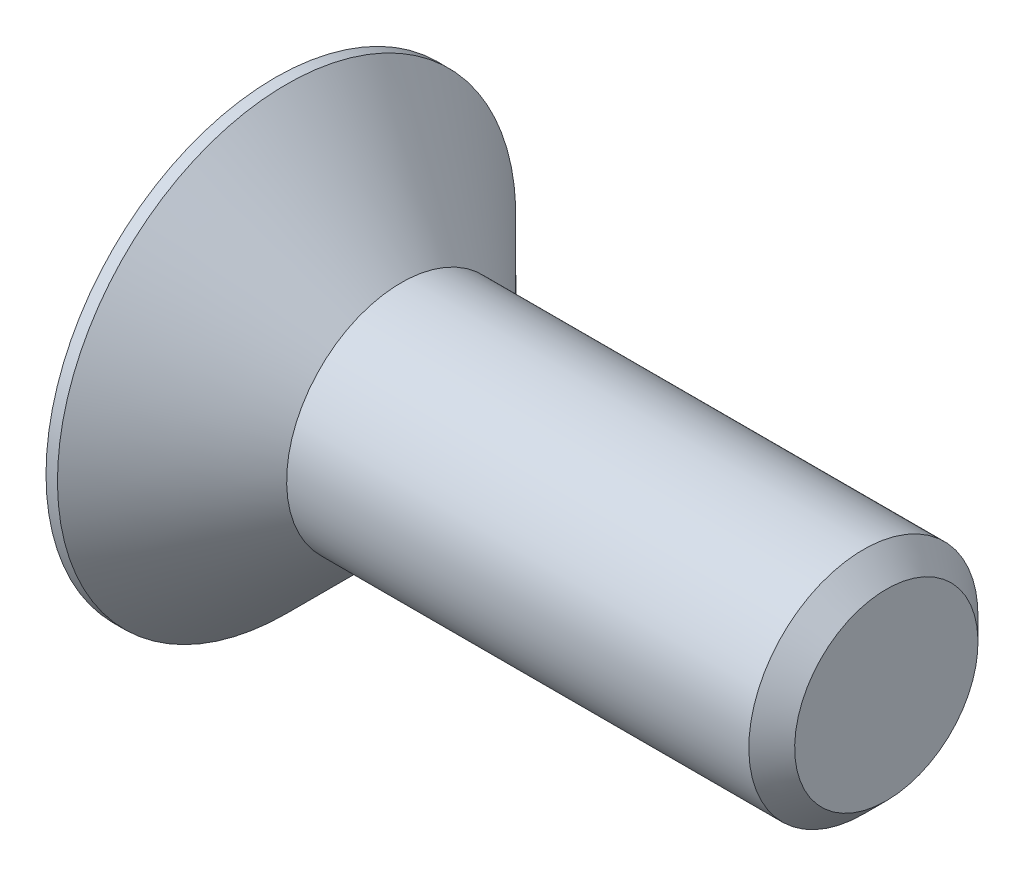
ISO-10303-21;
HEADER;
FILE_DESCRIPTION(('STEP AP214'),'2;1');
FILE_NAME('part.step','',(''),(''),'','','');
FILE_SCHEMA(('AUTOMOTIVE_DESIGN { 1 0 10303 214 1 1 1 1 }'));
ENDSEC;
DATA;
#1=APPLICATION_CONTEXT('core data for automotive mechanical design processes');
#2=APPLICATION_PROTOCOL_DEFINITION('international standard','automotive_design',2000,#1);
#3=PRODUCT_CONTEXT('',#1,'mechanical');
#4=PRODUCT('Part','Part','',(#3));
#5=PRODUCT_RELATED_PRODUCT_CATEGORY('part','',(#4));
#6=PRODUCT_DEFINITION_FORMATION('','',#4);
#7=PRODUCT_DEFINITION_CONTEXT('part definition',#1,'design');
#8=PRODUCT_DEFINITION('design','',#6,#7);
#9=PRODUCT_DEFINITION_SHAPE('','',#8);
#10=(LENGTH_UNIT() NAMED_UNIT(*) SI_UNIT(.MILLI.,.METRE.));
#11=(NAMED_UNIT(*) PLANE_ANGLE_UNIT() SI_UNIT($,.RADIAN.));
#12=(NAMED_UNIT(*) SI_UNIT($,.STERADIAN.) SOLID_ANGLE_UNIT());
#13=UNCERTAINTY_MEASURE_WITH_UNIT(LENGTH_MEASURE(1.E-05),#10,'distance_accuracy_value','');
#14=(GEOMETRIC_REPRESENTATION_CONTEXT(3) GLOBAL_UNCERTAINTY_ASSIGNED_CONTEXT((#13)) GLOBAL_UNIT_ASSIGNED_CONTEXT((#10,
#11,#12)) REPRESENTATION_CONTEXT('',''));
#15=CARTESIAN_POINT('',(0.,0.,0.));
#16=DIRECTION('',(0.,0.,1.));
#17=DIRECTION('',(1.,0.,0.));
#18=AXIS2_PLACEMENT_3D('',#15,#16,#17);
#19=CARTESIAN_POINT('',(1.65000000000121,32.4759531120805,-18.7500000629951));
#20=DIRECTION('',(-1.,0.,0.));
#21=DIRECTION('',(0.,-1.,0.));
#22=AXIS2_PLACEMENT_3D('',#19,#20,#21);
#23=PLANE('',#22);
#24=DIRECTION('',(0.,-0.5,-0.866025403784439));
#25=VECTOR('',#24,1.);
#26=CARTESIAN_POINT('',(1.65000000000109,30.7439023045116,-17.7500000629951));
#27=LINE('',#26,#25);
#28=CARTESIAN_POINT('',(1.65000000000112,30.166552035322,-18.7500000629951));
#29=VERTEX_POINT('',#28);
#30=CARTESIAN_POINT('',(1.65000000000109,31.3212525737013,-16.7500000629951));
#31=VERTEX_POINT('',#30);
#32=EDGE_CURVE('E83',#29,#31,#27,.F.);
#33=ORIENTED_EDGE('',*,*,#32,.T.);
#34=DIRECTION('',(0.,1.,0.));
#35=VECTOR('',#34,1.);
#36=CARTESIAN_POINT('',(1.65000000000109,32.4759531120806,-16.7500000629951));
#37=LINE('',#36,#35);
#38=CARTESIAN_POINT('',(1.65000000000118,33.6306536504597,-16.7500000629952));
#39=VERTEX_POINT('',#38);
#40=EDGE_CURVE('E67',#31,#39,#37,.T.);
#41=ORIENTED_EDGE('',*,*,#40,.T.);
#42=DIRECTION('',(0.,-0.5,0.866025403784439));
#43=VECTOR('',#42,1.);
#44=CARTESIAN_POINT('',(1.65000000000121,34.2080039196495,-17.7500000629952));
#45=LINE('',#44,#43);
#46=CARTESIAN_POINT('',(1.65000000000128,34.785354188839,-18.7500000629951));
#47=VERTEX_POINT('',#46);
#48=EDGE_CURVE('E72',#39,#47,#45,.F.);
#49=ORIENTED_EDGE('',*,*,#48,.T.);
#50=DIRECTION('',(0.,0.5,0.866025403784439));
#51=VECTOR('',#50,1.);
#52=CARTESIAN_POINT('',(1.65000000000134,34.2080039196494,-19.7500000629951));
#53=LINE('',#52,#51);
#54=CARTESIAN_POINT('',(1.65000000000134,33.6306536504598,-20.7500000629951));
#55=VERTEX_POINT('',#54);
#56=EDGE_CURVE('E121',#47,#55,#53,.F.);
#57=ORIENTED_EDGE('',*,*,#56,.T.);
#58=DIRECTION('',(0.,1.,0.));
#59=VECTOR('',#58,1.);
#60=CARTESIAN_POINT('',(1.65000000000134,32.4759531120806,-20.7500000629951));
#61=LINE('',#60,#59);
#62=CARTESIAN_POINT('',(1.65000000000125,31.3212525737012,-20.7500000629952));
#63=VERTEX_POINT('',#62);
#64=EDGE_CURVE('E125',#55,#63,#61,.F.);
#65=ORIENTED_EDGE('',*,*,#64,.T.);
#66=DIRECTION('',(0.,0.5,-0.866025403784439));
#67=VECTOR('',#66,1.);
#68=CARTESIAN_POINT('',(1.65000000000122,30.7439023045117,-19.7500000629952));
#69=LINE('',#68,#67);
#70=EDGE_CURVE('E130',#63,#29,#69,.F.);
#71=ORIENTED_EDGE('',*,*,#70,.T.);
#72=EDGE_LOOP('',(#33,#41,#49,#57,#65,#71));
#73=FACE_BOUND('',#72,.T.);
#74=ADVANCED_FACE('F17',(#73),#23,.T.);
#75=CARTESIAN_POINT('',(1.27932607314398E-12,34.2080039196495,-17.7500000629952));
#76=DIRECTION('',(0.,0.866025403784439,0.5));
#77=DIRECTION('',(0.,-0.5,0.866025403784439));
#78=AXIS2_PLACEMENT_3D('',#75,#76,#77);
#79=PLANE('',#78);
#80=DIRECTION('',(1.,0.,0.));
#81=VECTOR('',#80,1.);
#82=CARTESIAN_POINT('',(1.15022544125438E-12,33.6306536504597,-16.7500000629952));
#83=LINE('',#82,#81);
#84=CARTESIAN_POINT('',(1.27932607314397E-12,33.6306536504598,-16.7500000629952));
#85=VERTEX_POINT('',#84);
#86=EDGE_CURVE('E74',#39,#85,#83,.F.);
#87=ORIENTED_EDGE('',*,*,#86,.T.);
#88=DIRECTION('',(0.,-0.500000000000016,0.866025403784429));
#89=VECTOR('',#88,1.);
#90=CARTESIAN_POINT('',(1.34393761940646E-12,34.7853541888391,-18.7500000629952));
#91=LINE('',#90,#89);
#92=CARTESIAN_POINT('',(1.34399884972416E-12,34.7853541888391,-18.7500000629951));
#93=VERTEX_POINT('',#92);
#94=EDGE_CURVE('E119',#93,#85,#91,.T.);
#95=ORIENTED_EDGE('',*,*,#94,.F.);
#96=DIRECTION('',(1.,0.,0.));
#97=VECTOR('',#96,1.);
#98=CARTESIAN_POINT('',(1.34406008004185E-12,34.7853541888391,-18.7500000629952));
#99=LINE('',#98,#97);
#100=EDGE_CURVE('E77',#93,#47,#99,.T.);
#101=ORIENTED_EDGE('',*,*,#100,.T.);
#102=ORIENTED_EDGE('',*,*,#48,.F.);
#103=EDGE_LOOP('',(#87,#95,#101,#102));
#104=FACE_BOUND('',#103,.T.);
#105=ADVANCED_FACE('F73',(#104),#79,.F.);
#106=CARTESIAN_POINT('',(1.15022544125438E-12,32.4759531120806,-16.7500000629952));
#107=DIRECTION('',(0.,0.,1.));
#108=DIRECTION('',(1.,0.,0.));
#109=AXIS2_PLACEMENT_3D('',#106,#107,#108);
#110=PLANE('',#109);
#111=DIRECTION('',(1.,0.,0.));
#112=VECTOR('',#111,1.);
#113=CARTESIAN_POINT('',(1.08585881626266E-12,31.3212525737013,-16.7500000629952));
#114=LINE('',#113,#112);
#115=CARTESIAN_POINT('',(1.15022544125438E-12,31.3212525737013,-16.7500000629952));
#116=VERTEX_POINT('',#115);
#117=EDGE_CURVE('E85',#31,#116,#114,.F.);
#118=ORIENTED_EDGE('',*,*,#117,.T.);
#119=DIRECTION('',(0.,-1.,0.));
#120=VECTOR('',#119,1.);
#121=CARTESIAN_POINT('',(1.0051249985934E-12,29.8778769007273,-16.7500000629952));
#122=LINE('',#121,#120);
#123=EDGE_CURVE('E89',#85,#116,#122,.T.);
#124=ORIENTED_EDGE('',*,*,#123,.F.);
#125=ORIENTED_EDGE('',*,*,#86,.F.);
#126=ORIENTED_EDGE('',*,*,#40,.F.);
#127=EDGE_LOOP('',(#118,#124,#125,#126));
#128=FACE_BOUND('',#127,.T.);
#129=ADVANCED_FACE('F87',(#128),#110,.F.);
#130=CARTESIAN_POINT('',(1.08585881626266E-12,30.7439023045117,-17.7500000629952));
#131=DIRECTION('',(0.,-0.866025403784439,0.5));
#132=DIRECTION('',(0.,-0.5,-0.866025403784439));
#133=AXIS2_PLACEMENT_3D('',#130,#131,#132);
#134=PLANE('',#133);
#135=DIRECTION('',(1.,0.,0.));
#136=VECTOR('',#135,1.);
#137=CARTESIAN_POINT('',(1.15059282316053E-12,30.166552035322,-18.7500000629951));
#138=LINE('',#137,#136);
#139=CARTESIAN_POINT('',(1.08585881626266E-12,30.1665520353221,-18.7500000629952));
#140=VERTEX_POINT('',#139);
#141=EDGE_CURVE('E132',#29,#140,#138,.F.);
#142=ORIENTED_EDGE('',*,*,#141,.T.);
#143=DIRECTION('',(0.,-0.499999999999985,-0.866025403784447));
#144=VECTOR('',#143,1.);
#145=CARTESIAN_POINT('',(1.08573635562728E-12,31.3212525737013,-16.7500000629952));
#146=LINE('',#145,#144);
#147=EDGE_CURVE('E115',#116,#140,#146,.T.);
#148=ORIENTED_EDGE('',*,*,#147,.F.);
#149=ORIENTED_EDGE('',*,*,#117,.F.);
#150=ORIENTED_EDGE('',*,*,#32,.F.);
#151=EDGE_LOOP('',(#142,#148,#149,#150));
#152=FACE_BOUND('',#151,.T.);
#153=ADVANCED_FACE('F136',(#152),#134,.F.);
#154=CARTESIAN_POINT('',(1.15059282316053E-12,30.7439023045117,-19.7500000629952));
#155=DIRECTION('',(0.,-0.866025403784439,-0.5));
#156=DIRECTION('',(0.,0.5,-0.866025403784439));
#157=AXIS2_PLACEMENT_3D('',#154,#155,#156);
#158=PLANE('',#157);
#159=DIRECTION('',(-1.,0.,0.));
#160=VECTOR('',#159,1.);
#161=CARTESIAN_POINT('',(1.27969345505012E-12,31.3212525737012,-20.7500000629952));
#162=LINE('',#161,#160);
#163=CARTESIAN_POINT('',(1.15059282316053E-12,31.3212525737013,-20.7500000629952));
#164=VERTEX_POINT('',#163);
#165=EDGE_CURVE('E128',#63,#164,#162,.T.);
#166=ORIENTED_EDGE('',*,*,#165,.T.);
#167=DIRECTION('',(0.,0.499999999999984,-0.866025403784448));
#168=VECTOR('',#167,1.);
#169=CARTESIAN_POINT('',(1.08598127689804E-12,30.1665520353221,-18.7500000629952));
#170=LINE('',#169,#168);
#171=EDGE_CURVE('E109',#140,#164,#170,.T.);
#172=ORIENTED_EDGE('',*,*,#171,.F.);
#173=ORIENTED_EDGE('',*,*,#141,.F.);
#174=ORIENTED_EDGE('',*,*,#70,.F.);
#175=EDGE_LOOP('',(#166,#172,#173,#174));
#176=FACE_BOUND('',#175,.T.);
#177=ADVANCED_FACE('F145',(#176),#158,.F.);
#178=CARTESIAN_POINT('',(1.27969345505012E-12,32.4759531120806,-20.7500000629952));
#179=DIRECTION('',(0.,0.,-1.));
#180=DIRECTION('',(-1.,0.,0.));
#181=AXIS2_PLACEMENT_3D('',#178,#179,#180);
#182=PLANE('',#181);
#183=DIRECTION('',(1.,0.,0.));
#184=VECTOR('',#183,1.);
#185=CARTESIAN_POINT('',(1.34406008004185E-12,33.6306536504599,-20.7500000629952));
#186=LINE('',#185,#184);
#187=CARTESIAN_POINT('',(1.27969345505013E-12,33.6306536504598,-20.7500000629952));
#188=VERTEX_POINT('',#187);
#189=EDGE_CURVE('E35',#55,#188,#186,.F.);
#190=ORIENTED_EDGE('',*,*,#189,.T.);
#191=DIRECTION('',(0.,-1.,0.));
#192=VECTOR('',#191,1.);
#193=CARTESIAN_POINT('',(1.13459301238914E-12,29.8778769007273,-20.7500000629952));
#194=LINE('',#193,#192);
#195=EDGE_CURVE('E105',#164,#188,#194,.F.);
#196=ORIENTED_EDGE('',*,*,#195,.F.);
#197=ORIENTED_EDGE('',*,*,#165,.F.);
#198=ORIENTED_EDGE('',*,*,#64,.F.);
#199=EDGE_LOOP('',(#190,#196,#197,#198));
#200=FACE_BOUND('',#199,.T.);
#201=ADVANCED_FACE('F143',(#200),#182,.F.);
#202=CARTESIAN_POINT('',(1.34406008004185E-12,34.2080039196495,-19.7500000629952));
#203=DIRECTION('',(0.,0.866025403784439,-0.5));
#204=DIRECTION('',(0.,0.5,0.866025403784439));
#205=AXIS2_PLACEMENT_3D('',#202,#203,#204);
#206=PLANE('',#205);
#207=ORIENTED_EDGE('',*,*,#100,.F.);
#208=DIRECTION('',(0.,0.500000000000016,0.866025403784429));
#209=VECTOR('',#208,1.);
#210=CARTESIAN_POINT('',(1.34418254067723E-12,33.6306536504598,-20.7500000629952));
#211=LINE('',#210,#209);
#212=EDGE_CURVE('E101',#188,#93,#211,.T.);
#213=ORIENTED_EDGE('',*,*,#212,.F.);
#214=ORIENTED_EDGE('',*,*,#189,.F.);
#215=ORIENTED_EDGE('',*,*,#56,.F.);
#216=EDGE_LOOP('',(#207,#213,#214,#215));
#217=FACE_BOUND('',#216,.T.);
#218=ADVANCED_FACE('F141',(#217),#206,.F.);
#219=CARTESIAN_POINT('',(1.11840951066467E-12,29.8778769007273,-20.2500000629952));
#220=DIRECTION('',(-1.,0.,0.));
#221=DIRECTION('',(0.,-1.,0.));
#222=AXIS2_PLACEMENT_3D('',#219,#220,#221);
#223=PLANE('',#222);
#224=CARTESIAN_POINT('',(1.21503826965019E-12,32.4759531120806,-18.7500000629952));
#225=DIRECTION('',(-1.,0.,0.));
#226=DIRECTION('',(0.,-1.,0.));
#227=AXIS2_PLACEMENT_3D('',#224,#225,#226);
#228=CIRCLE('',#227,6.);
#229=CARTESIAN_POINT('',(8.7988371580946E-13,26.4759531120806,-18.7500000629952));
#230=VERTEX_POINT('',#229);
#231=EDGE_CURVE('E20',#230,#230,#228,.F.);
#232=ORIENTED_EDGE('',*,*,#231,.F.);
#233=EDGE_LOOP('',(#232));
#234=FACE_BOUND('',#233,.T.);
#235=ORIENTED_EDGE('',*,*,#195,.T.);
#236=ORIENTED_EDGE('',*,*,#212,.T.);
#237=ORIENTED_EDGE('',*,*,#94,.T.);
#238=ORIENTED_EDGE('',*,*,#123,.T.);
#239=ORIENTED_EDGE('',*,*,#147,.T.);
#240=ORIENTED_EDGE('',*,*,#171,.T.);
#241=EDGE_LOOP('',(#235,#236,#237,#238,#239,#240));
#242=FACE_BOUND('',#241,.T.);
#243=ADVANCED_FACE('F139',(#234,#242),#223,.T.);
#244=CARTESIAN_POINT('',(16.0000000000012,31.176915006403,-19.5000000629947));
#245=DIRECTION('',(1.,0.,0.));
#246=DIRECTION('',(0.,1.,0.));
#247=AXIS2_PLACEMENT_3D('',#244,#245,#246);
#248=PLANE('',#247);
#249=CARTESIAN_POINT('',(15.9999999999692,32.4759531120797,-18.7500000629947));
#250=DIRECTION('',(-1.,0.,0.));
#251=DIRECTION('',(0.,-1.,0.));
#252=AXIS2_PLACEMENT_3D('',#249,#250,#251);
#253=CIRCLE('',#252,2.40000000001179);
#254=CARTESIAN_POINT('',(15.9999999999691,30.0759531120679,-18.7500000629947));
#255=VERTEX_POINT('',#254);
#256=EDGE_CURVE('E96',#255,#255,#253,.T.);
#257=ORIENTED_EDGE('',*,*,#256,.F.);
#258=EDGE_LOOP('',(#257));
#259=FACE_BOUND('',#258,.T.);
#260=ADVANCED_FACE('F175',(#259),#248,.T.);
#261=CARTESIAN_POINT('',(0.150000000001216,32.4759531120806,-18.7500000629952));
#262=DIRECTION('',(-1.,0.,0.));
#263=DIRECTION('',(0.,-1.,0.));
#264=AXIS2_PLACEMENT_3D('',#261,#262,#263);
#265=CYLINDRICAL_SURFACE('',#264,6.);
#266=ORIENTED_EDGE('',*,*,#231,.T.);
#267=EDGE_LOOP('',(#266));
#268=FACE_BOUND('',#267,.T.);
#269=CARTESIAN_POINT('',(0.299999999981731,32.4759531120806,-18.7500000629951));
#270=DIRECTION('',(-1.,0.,0.));
#271=DIRECTION('',(0.,-0.866025403781574,-0.500000000004961));
#272=AXIS2_PLACEMENT_3D('',#269,#270,#271);
#273=CIRCLE('',#272,6.00000000002342);
#274=CARTESIAN_POINT('',(0.299999999981537,27.2798006893709,-21.7500000630366));
#275=VERTEX_POINT('',#274);
#276=EDGE_CURVE('E94',#275,#275,#273,.F.);
#277=ORIENTED_EDGE('',*,*,#276,.F.);
#278=EDGE_LOOP('',(#277));
#279=FACE_BOUND('',#278,.T.);
#280=ADVANCED_FACE('F171',(#268,#279),#265,.T.);
#281=CARTESIAN_POINT('',(15.3999999997722,32.4759531120797,-18.7500000629947));
#282=DIRECTION('',(-1.,0.,0.));
#283=DIRECTION('',(0.,-1.,0.));
#284=AXIS2_PLACEMENT_3D('',#281,#282,#283);
#285=CONICAL_SURFACE('',#284,3.00000000024393,0.785398163426681);
#286=CARTESIAN_POINT('',(15.4000000000012,32.4759531120797,-18.7500000629947));
#287=DIRECTION('',(-1.,0.,0.));
#288=DIRECTION('',(0.,-1.,0.));
#289=AXIS2_PLACEMENT_3D('',#286,#287,#288);
#290=CIRCLE('',#289,3.);
#291=CARTESIAN_POINT('',(15.400000000001,29.4759531120797,-18.7500000629947));
#292=VERTEX_POINT('',#291);
#293=EDGE_CURVE('E26',#292,#292,#290,.T.);
#294=ORIENTED_EDGE('',*,*,#293,.F.);
#295=EDGE_LOOP('',(#294));
#296=FACE_BOUND('',#295,.T.);
#297=ORIENTED_EDGE('',*,*,#256,.T.);
#298=EDGE_LOOP('',(#297));
#299=FACE_BOUND('',#298,.T.);
#300=ADVANCED_FACE('F163',(#296,#299),#285,.T.);
#301=CARTESIAN_POINT('',(0.300000000152261,32.4759531120806,-18.7500000629951));
#302=DIRECTION('',(-1.,0.,0.));
#303=DIRECTION('',(0.,-1.,0.));
#304=AXIS2_PLACEMENT_3D('',#301,#302,#303);
#305=CONICAL_SURFACE('',#304,5.9999999998331,0.785398163396805);
#306=CARTESIAN_POINT('',(3.30000000000121,32.4759531120804,-18.7500000629951));
#307=DIRECTION('',(-1.,0.,0.));
#308=DIRECTION('',(0.,-1.,0.));
#309=AXIS2_PLACEMENT_3D('',#306,#307,#308);
#310=CIRCLE('',#309,3.);
#311=CARTESIAN_POINT('',(3.30000000000105,29.4759531120804,-18.7500000629951));
#312=VERTEX_POINT('',#311);
#313=EDGE_CURVE('E11',#312,#312,#310,.F.);
#314=ORIENTED_EDGE('',*,*,#313,.F.);
#315=EDGE_LOOP('',(#314));
#316=FACE_BOUND('',#315,.T.);
#317=ORIENTED_EDGE('',*,*,#276,.T.);
#318=EDGE_LOOP('',(#317));
#319=FACE_BOUND('',#318,.T.);
#320=ADVANCED_FACE('F157',(#316,#319),#305,.T.);
#321=CARTESIAN_POINT('',(9.65000000000121,32.47595311208,-18.7500000629949));
#322=DIRECTION('',(-1.,0.,0.));
#323=DIRECTION('',(0.,-1.,0.));
#324=AXIS2_PLACEMENT_3D('',#321,#322,#323);
#325=CYLINDRICAL_SURFACE('',#324,3.);
#326=ORIENTED_EDGE('',*,*,#293,.T.);
#327=EDGE_LOOP('',(#326));
#328=FACE_BOUND('',#327,.T.);
#329=ORIENTED_EDGE('',*,*,#313,.T.);
#330=EDGE_LOOP('',(#329));
#331=FACE_BOUND('',#330,.T.);
#332=ADVANCED_FACE('F155',(#328,#331),#325,.T.);
#333=CLOSED_SHELL('',(#74,#105,#129,#153,#177,#201,#218,#243,#260,#280,#300,#320,#332));
#334=MANIFOLD_SOLID_BREP('B1',#333);
#335=ADVANCED_BREP_SHAPE_REPRESENTATION('',(#18,#334),#14);
#336=SHAPE_DEFINITION_REPRESENTATION(#9,#335);
ENDSEC;
END-ISO-10303-21;
